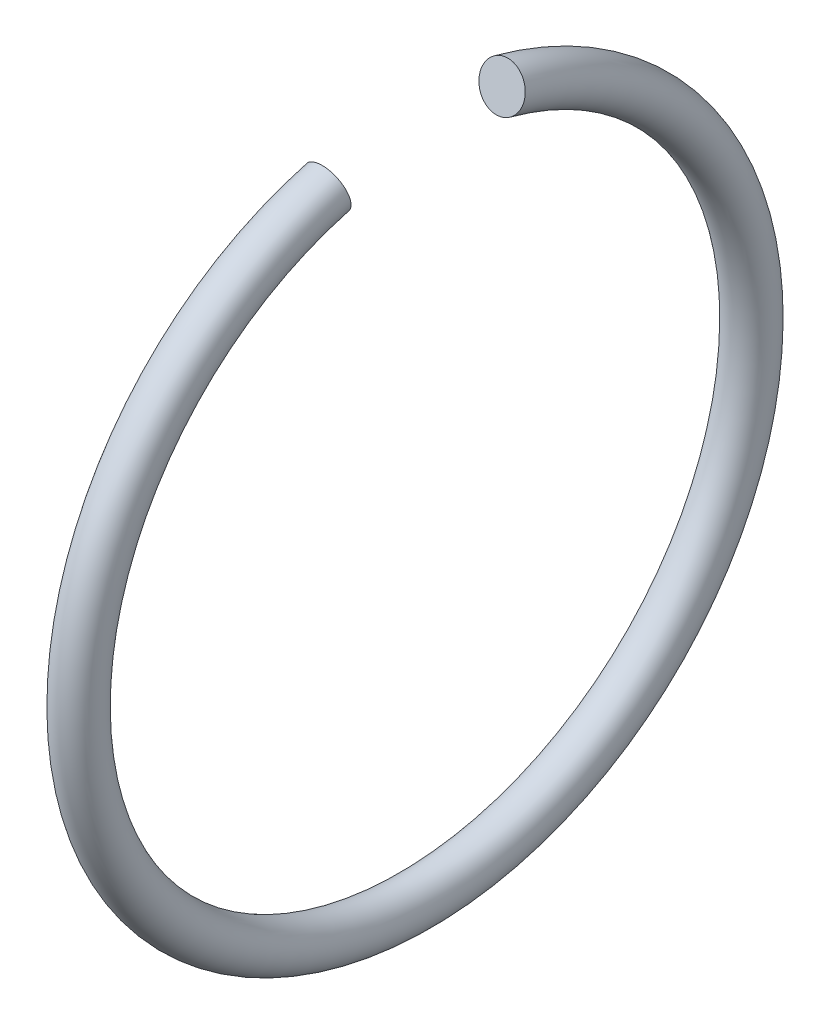
ISO-10303-21;
HEADER;
FILE_DESCRIPTION(('STEP AP214'),'2;1');
FILE_NAME('part.step','',(''),(''),'','','');
FILE_SCHEMA(('AUTOMOTIVE_DESIGN { 1 0 10303 214 1 1 1 1 }'));
ENDSEC;
DATA;
#1=APPLICATION_CONTEXT('core data for automotive mechanical design processes');
#2=APPLICATION_PROTOCOL_DEFINITION('international standard','automotive_design',2000,#1);
#3=PRODUCT_CONTEXT('',#1,'mechanical');
#4=PRODUCT('Part','Part','',(#3));
#5=PRODUCT_RELATED_PRODUCT_CATEGORY('part','',(#4));
#6=PRODUCT_DEFINITION_FORMATION('','',#4);
#7=PRODUCT_DEFINITION_CONTEXT('part definition',#1,'design');
#8=PRODUCT_DEFINITION('design','',#6,#7);
#9=PRODUCT_DEFINITION_SHAPE('','',#8);
#10=(LENGTH_UNIT() NAMED_UNIT(*) SI_UNIT(.MILLI.,.METRE.));
#11=(NAMED_UNIT(*) PLANE_ANGLE_UNIT() SI_UNIT($,.RADIAN.));
#12=(NAMED_UNIT(*) SI_UNIT($,.STERADIAN.) SOLID_ANGLE_UNIT());
#13=UNCERTAINTY_MEASURE_WITH_UNIT(LENGTH_MEASURE(1.E-05),#10,'distance_accuracy_value','');
#14=(GEOMETRIC_REPRESENTATION_CONTEXT(3) GLOBAL_UNCERTAINTY_ASSIGNED_CONTEXT((#13)) GLOBAL_UNIT_ASSIGNED_CONTEXT((#10,
#11,#12)) REPRESENTATION_CONTEXT('',''));
#15=CARTESIAN_POINT('',(0.,0.,0.));
#16=DIRECTION('',(0.,0.,1.));
#17=DIRECTION('',(1.,0.,0.));
#18=AXIS2_PLACEMENT_3D('',#15,#16,#17);
#19=CARTESIAN_POINT('',(-325.05,0.,0.));
#20=DIRECTION('',(1.,0.,0.));
#21=DIRECTION('',(0.,1.,0.));
#22=AXIS2_PLACEMENT_3D('',#19,#20,#21);
#23=TOROIDAL_SURFACE('',#22,15.,0.999999999999998);
#24=CARTESIAN_POINT('',(-325.05,14.488887394336,3.88228567653769));
#25=DIRECTION('',(0.,0.258819045102515,-0.96592582628907));
#26=DIRECTION('',(1.,0.,0.));
#27=AXIS2_PLACEMENT_3D('',#24,#25,#26);
#28=CIRCLE('',#27,0.999999999999998);
#29=CARTESIAN_POINT('',(-325.05,15.4548132206251,4.1411047216402));
#30=VERTEX_POINT('',#29);
#31=EDGE_CURVE('E10',#30,#30,#28,.T.);
#32=CARTESIAN_POINT('',(-325.05,14.488887394336,-3.88228567653773));
#33=DIRECTION('',(0.,-0.258819045102515,-0.96592582628907));
#34=DIRECTION('',(1.,0.,0.));
#35=AXIS2_PLACEMENT_3D('',#32,#33,#34);
#36=CIRCLE('',#35,0.999999999999998);
#37=CARTESIAN_POINT('',(-325.05,15.4548132206251,-4.14110472164025));
#38=VERTEX_POINT('',#37);
#39=EDGE_CURVE('E40',#38,#38,#36,.T.);
#40=CARTESIAN_POINT('',(-325.05,0.,0.));
#41=DIRECTION('',(1.,0.,0.));
#42=DIRECTION('',(0.,1.,0.));
#43=AXIS2_PLACEMENT_3D('',#40,#41,#42);
#44=CIRCLE('',#43,16.);
#45=EDGE_CURVE('',#30,#38,#44,.T.);
#46=ORIENTED_EDGE('',*,*,#31,.F.);
#47=ORIENTED_EDGE('',*,*,#39,.T.);
#48=ORIENTED_EDGE('',*,*,#45,.T.);
#49=ORIENTED_EDGE('',*,*,#45,.F.);
#50=EDGE_LOOP('',(#46,#48,#47,#49));
#51=FACE_BOUND('',#50,.T.);
#52=ADVANCED_FACE('F34',(#51),#23,.T.);
#53=CARTESIAN_POINT('',(-325.05,14.488887394336,3.88228567653769));
#54=DIRECTION('',(0.,0.258819045102515,-0.96592582628907));
#55=DIRECTION('',(1.,0.,0.));
#56=AXIS2_PLACEMENT_3D('',#53,#54,#55);
#57=PLANE('',#56);
#58=ORIENTED_EDGE('',*,*,#31,.T.);
#59=EDGE_LOOP('',(#58));
#60=FACE_BOUND('',#59,.T.);
#61=ADVANCED_FACE('F49',(#60),#57,.T.);
#62=CARTESIAN_POINT('',(-325.05,14.488887394336,-3.88228567653773));
#63=DIRECTION('',(0.,-0.258819045102515,-0.96592582628907));
#64=DIRECTION('',(1.,0.,0.));
#65=AXIS2_PLACEMENT_3D('',#62,#63,#64);
#66=PLANE('',#65);
#67=ORIENTED_EDGE('',*,*,#39,.F.);
#68=EDGE_LOOP('',(#67));
#69=FACE_BOUND('',#68,.T.);
#70=ADVANCED_FACE('F47',(#69),#66,.F.);
#71=CLOSED_SHELL('',(#52,#61,#70));
#72=MANIFOLD_SOLID_BREP('B2',#71);
#73=ADVANCED_BREP_SHAPE_REPRESENTATION('',(#18,#72),#14);
#74=SHAPE_DEFINITION_REPRESENTATION(#9,#73);
ENDSEC;
END-ISO-10303-21;
